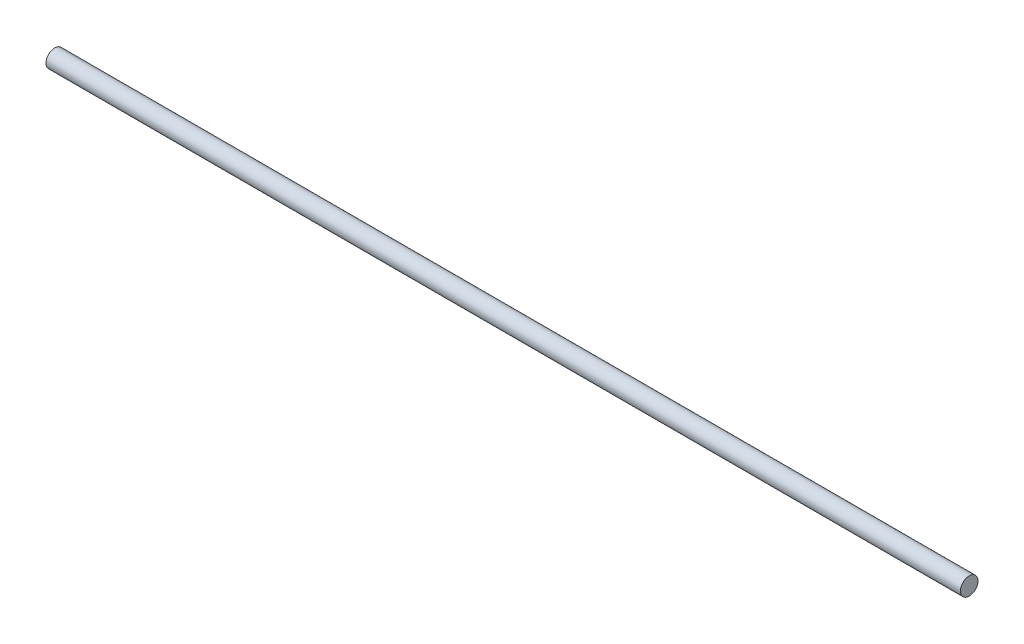
ISO-10303-21;
HEADER;
FILE_DESCRIPTION(('STEP AP214'),'2;1');
FILE_NAME('part.step','',(''),(''),'','','');
FILE_SCHEMA(('AUTOMOTIVE_DESIGN { 1 0 10303 214 1 1 1 1 }'));
ENDSEC;
DATA;
#1=APPLICATION_CONTEXT('core data for automotive mechanical design processes');
#2=APPLICATION_PROTOCOL_DEFINITION('international standard','automotive_design',2000,#1);
#3=PRODUCT_CONTEXT('',#1,'mechanical');
#4=PRODUCT('Part','Part','',(#3));
#5=PRODUCT_RELATED_PRODUCT_CATEGORY('part','',(#4));
#6=PRODUCT_DEFINITION_FORMATION('','',#4);
#7=PRODUCT_DEFINITION_CONTEXT('part definition',#1,'design');
#8=PRODUCT_DEFINITION('design','',#6,#7);
#9=PRODUCT_DEFINITION_SHAPE('','',#8);
#10=(LENGTH_UNIT() NAMED_UNIT(*) SI_UNIT(.MILLI.,.METRE.));
#11=(NAMED_UNIT(*) PLANE_ANGLE_UNIT() SI_UNIT($,.RADIAN.));
#12=(NAMED_UNIT(*) SI_UNIT($,.STERADIAN.) SOLID_ANGLE_UNIT());
#13=UNCERTAINTY_MEASURE_WITH_UNIT(LENGTH_MEASURE(1.E-05),#10,'distance_accuracy_value','');
#14=(GEOMETRIC_REPRESENTATION_CONTEXT(3) GLOBAL_UNCERTAINTY_ASSIGNED_CONTEXT((#13)) GLOBAL_UNIT_ASSIGNED_CONTEXT((#10,
#11,#12)) REPRESENTATION_CONTEXT('',''));
#15=CARTESIAN_POINT('',(0.,0.,0.));
#16=DIRECTION('',(0.,0.,1.));
#17=DIRECTION('',(1.,0.,0.));
#18=AXIS2_PLACEMENT_3D('',#15,#16,#17);
#19=CARTESIAN_POINT('',(330.2,0.,0.));
#20=DIRECTION('',(-1.,0.,0.));
#21=DIRECTION('',(0.,0.,1.));
#22=AXIS2_PLACEMENT_3D('',#19,#20,#21);
#23=CYLINDRICAL_SURFACE('',#22,6.35);
#24=CARTESIAN_POINT('',(330.2,0.,0.));
#25=DIRECTION('',(1.,0.,0.));
#26=DIRECTION('',(0.,0.,-1.));
#27=AXIS2_PLACEMENT_3D('',#24,#25,#26);
#28=CIRCLE('',#27,6.35);
#29=CARTESIAN_POINT('',(330.2,0.,-6.35));
#30=VERTEX_POINT('',#29);
#31=EDGE_CURVE('E10',#30,#30,#28,.T.);
#32=ORIENTED_EDGE('',*,*,#31,.F.);
#33=EDGE_LOOP('',(#32));
#34=FACE_BOUND('',#33,.T.);
#35=CARTESIAN_POINT('',(-330.2,0.,0.));
#36=DIRECTION('',(1.,0.,0.));
#37=DIRECTION('',(0.,0.,-1.));
#38=AXIS2_PLACEMENT_3D('',#35,#36,#37);
#39=CIRCLE('',#38,6.35);
#40=CARTESIAN_POINT('',(-330.2,0.,-6.35));
#41=VERTEX_POINT('',#40);
#42=EDGE_CURVE('E34',#41,#41,#39,.T.);
#43=ORIENTED_EDGE('',*,*,#42,.T.);
#44=EDGE_LOOP('',(#43));
#45=FACE_BOUND('',#44,.T.);
#46=ADVANCED_FACE('F31',(#34,#45),#23,.T.);
#47=CARTESIAN_POINT('',(330.2,0.,0.));
#48=DIRECTION('',(1.,0.,0.));
#49=DIRECTION('',(0.,0.,-1.));
#50=AXIS2_PLACEMENT_3D('',#47,#48,#49);
#51=PLANE('',#50);
#52=ORIENTED_EDGE('',*,*,#31,.T.);
#53=EDGE_LOOP('',(#52));
#54=FACE_BOUND('',#53,.T.);
#55=ADVANCED_FACE('F46',(#54),#51,.T.);
#56=CARTESIAN_POINT('',(-330.2,0.,0.));
#57=DIRECTION('',(1.,0.,0.));
#58=DIRECTION('',(0.,0.,-1.));
#59=AXIS2_PLACEMENT_3D('',#56,#57,#58);
#60=PLANE('',#59);
#61=ORIENTED_EDGE('',*,*,#42,.F.);
#62=EDGE_LOOP('',(#61));
#63=FACE_BOUND('',#62,.T.);
#64=ADVANCED_FACE('F44',(#63),#60,.F.);
#65=CLOSED_SHELL('',(#46,#55,#64));
#66=MANIFOLD_SOLID_BREP('B2',#65);
#67=ADVANCED_BREP_SHAPE_REPRESENTATION('',(#18,#66),#14);
#68=SHAPE_DEFINITION_REPRESENTATION(#9,#67);
ENDSEC;
END-ISO-10303-21;
